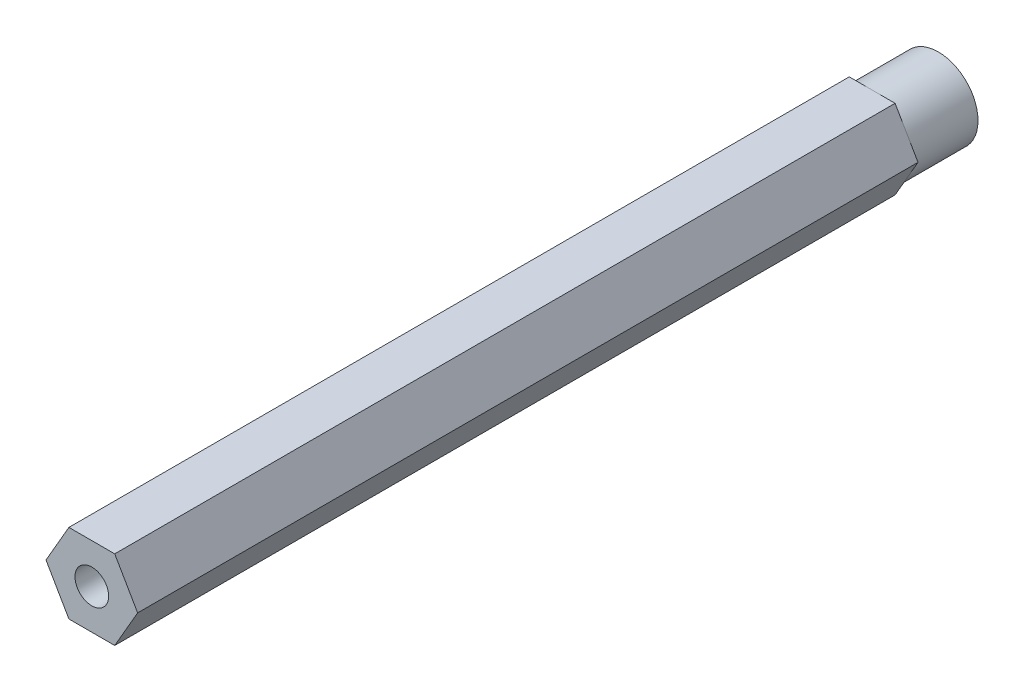
ISO-10303-21;
HEADER;
FILE_DESCRIPTION(('STEP AP214'),'2;1');
FILE_NAME('part.step','',(''),(''),'','','');
FILE_SCHEMA(('AUTOMOTIVE_DESIGN { 1 0 10303 214 1 1 1 1 }'));
ENDSEC;
DATA;
#1=APPLICATION_CONTEXT('core data for automotive mechanical design processes');
#2=APPLICATION_PROTOCOL_DEFINITION('international standard','automotive_design',2000,#1);
#3=PRODUCT_CONTEXT('',#1,'mechanical');
#4=PRODUCT('Part','Part','',(#3));
#5=PRODUCT_RELATED_PRODUCT_CATEGORY('part','',(#4));
#6=PRODUCT_DEFINITION_FORMATION('','',#4);
#7=PRODUCT_DEFINITION_CONTEXT('part definition',#1,'design');
#8=PRODUCT_DEFINITION('design','',#6,#7);
#9=PRODUCT_DEFINITION_SHAPE('','',#8);
#10=(LENGTH_UNIT() NAMED_UNIT(*) SI_UNIT(.MILLI.,.METRE.));
#11=(NAMED_UNIT(*) PLANE_ANGLE_UNIT() SI_UNIT($,.RADIAN.));
#12=(NAMED_UNIT(*) SI_UNIT($,.STERADIAN.) SOLID_ANGLE_UNIT());
#13=UNCERTAINTY_MEASURE_WITH_UNIT(LENGTH_MEASURE(1.E-05),#10,'distance_accuracy_value','');
#14=(GEOMETRIC_REPRESENTATION_CONTEXT(3) GLOBAL_UNCERTAINTY_ASSIGNED_CONTEXT((#13)) GLOBAL_UNIT_ASSIGNED_CONTEXT((#10,
#11,#12)) REPRESENTATION_CONTEXT('',''));
#15=CARTESIAN_POINT('',(0.,0.,0.));
#16=DIRECTION('',(0.,0.,1.));
#17=DIRECTION('',(1.,0.,0.));
#18=AXIS2_PLACEMENT_3D('',#15,#16,#17);
#19=CARTESIAN_POINT('',(-2.74963065701559,-4.7625,101.6));
#20=DIRECTION('',(0.,1.,0.));
#21=DIRECTION('',(-1.,0.,0.));
#22=AXIS2_PLACEMENT_3D('',#19,#20,#21);
#23=PLANE('',#22);
#24=DIRECTION('',(-1.,0.,0.));
#25=VECTOR('',#24,1.);
#26=CARTESIAN_POINT('',(-2.74963065701559,-4.7625,7.9375));
#27=LINE('',#26,#25);
#28=CARTESIAN_POINT('',(2.7496306570156,-4.7625,7.9375));
#29=VERTEX_POINT('',#28);
#30=CARTESIAN_POINT('',(0.,-4.7625,7.9375));
#31=VERTEX_POINT('',#30);
#32=EDGE_CURVE('E137',#29,#31,#27,.T.);
#33=ORIENTED_EDGE('',*,*,#32,.F.);
#34=DIRECTION('',(0.,0.,-1.));
#35=VECTOR('',#34,1.);
#36=CARTESIAN_POINT('',(2.7496306570156,-4.7625,101.6));
#37=LINE('',#36,#35);
#38=CARTESIAN_POINT('',(2.7496306570156,-4.7625,101.6));
#39=VERTEX_POINT('',#38);
#40=EDGE_CURVE('E177',#39,#29,#37,.T.);
#41=ORIENTED_EDGE('',*,*,#40,.F.);
#42=DIRECTION('',(1.,0.,0.));
#43=VECTOR('',#42,1.);
#44=CARTESIAN_POINT('',(-2.74963065701559,-4.7625,101.6));
#45=LINE('',#44,#43);
#46=CARTESIAN_POINT('',(-2.74963065701559,-4.7625,101.6));
#47=VERTEX_POINT('',#46);
#48=EDGE_CURVE('E154',#47,#39,#45,.T.);
#49=ORIENTED_EDGE('',*,*,#48,.F.);
#50=DIRECTION('',(0.,0.,-1.));
#51=VECTOR('',#50,1.);
#52=CARTESIAN_POINT('',(-2.74963065701559,-4.7625,101.6));
#53=LINE('',#52,#51);
#54=CARTESIAN_POINT('',(-2.74963065701559,-4.7625,7.9375));
#55=VERTEX_POINT('',#54);
#56=EDGE_CURVE('E165',#47,#55,#53,.T.);
#57=ORIENTED_EDGE('',*,*,#56,.T.);
#58=EDGE_CURVE('E116',#31,#55,#27,.T.);
#59=ORIENTED_EDGE('',*,*,#58,.F.);
#60=EDGE_LOOP('',(#33,#41,#49,#57,#59));
#61=FACE_BOUND('',#60,.T.);
#62=ADVANCED_FACE('F36',(#61),#23,.F.);
#63=CARTESIAN_POINT('',(2.7496306570156,-4.7625,101.6));
#64=DIRECTION('',(-0.866025403784439,0.5,0.));
#65=DIRECTION('',(-0.5,-0.866025403784439,0.));
#66=AXIS2_PLACEMENT_3D('',#63,#64,#65);
#67=PLANE('',#66);
#68=DIRECTION('',(-0.5,-0.866025403784439,0.));
#69=VECTOR('',#68,1.);
#70=CARTESIAN_POINT('',(2.7496306570156,-4.7625,7.9375));
#71=LINE('',#70,#69);
#72=CARTESIAN_POINT('',(5.49926131403119,0.,7.9375));
#73=VERTEX_POINT('',#72);
#74=CARTESIAN_POINT('',(4.12444598552339,-2.38125,7.9375));
#75=VERTEX_POINT('',#74);
#76=EDGE_CURVE('E144',#73,#75,#71,.T.);
#77=ORIENTED_EDGE('',*,*,#76,.F.);
#78=DIRECTION('',(0.,0.,-1.));
#79=VECTOR('',#78,1.);
#80=CARTESIAN_POINT('',(5.49926131403119,0.,101.6));
#81=LINE('',#80,#79);
#82=CARTESIAN_POINT('',(5.49926131403119,0.,101.6));
#83=VERTEX_POINT('',#82);
#84=EDGE_CURVE('E174',#83,#73,#81,.T.);
#85=ORIENTED_EDGE('',*,*,#84,.F.);
#86=DIRECTION('',(0.5,0.866025403784439,0.));
#87=VECTOR('',#86,1.);
#88=CARTESIAN_POINT('',(2.7496306570156,-4.7625,101.6));
#89=LINE('',#88,#87);
#90=EDGE_CURVE('E156',#39,#83,#89,.T.);
#91=ORIENTED_EDGE('',*,*,#90,.F.);
#92=ORIENTED_EDGE('',*,*,#40,.T.);
#93=EDGE_CURVE('E138',#75,#29,#71,.T.);
#94=ORIENTED_EDGE('',*,*,#93,.F.);
#95=EDGE_LOOP('',(#77,#85,#91,#92,#94));
#96=FACE_BOUND('',#95,.T.);
#97=ADVANCED_FACE('F201',(#96),#67,.F.);
#98=CARTESIAN_POINT('',(5.49926131403119,0.,101.6));
#99=DIRECTION('',(-0.866025403784438,-0.5,0.));
#100=DIRECTION('',(0.5,-0.866025403784438,0.));
#101=AXIS2_PLACEMENT_3D('',#98,#99,#100);
#102=PLANE('',#101);
#103=DIRECTION('',(0.5,-0.866025403784438,0.));
#104=VECTOR('',#103,1.);
#105=CARTESIAN_POINT('',(5.49926131403119,0.,7.9375));
#106=LINE('',#105,#104);
#107=CARTESIAN_POINT('',(2.74963065701559,4.7625,7.9375));
#108=VERTEX_POINT('',#107);
#109=CARTESIAN_POINT('',(4.12444598552339,2.38125,7.9375));
#110=VERTEX_POINT('',#109);
#111=EDGE_CURVE('E147',#108,#110,#106,.T.);
#112=ORIENTED_EDGE('',*,*,#111,.F.);
#113=DIRECTION('',(0.,0.,-1.));
#114=VECTOR('',#113,1.);
#115=CARTESIAN_POINT('',(2.74963065701559,4.7625,101.6));
#116=LINE('',#115,#114);
#117=CARTESIAN_POINT('',(2.74963065701559,4.7625,101.6));
#118=VERTEX_POINT('',#117);
#119=EDGE_CURVE('E171',#118,#108,#116,.T.);
#120=ORIENTED_EDGE('',*,*,#119,.F.);
#121=DIRECTION('',(-0.5,0.866025403784438,0.));
#122=VECTOR('',#121,1.);
#123=CARTESIAN_POINT('',(5.49926131403119,0.,101.6));
#124=LINE('',#123,#122);
#125=EDGE_CURVE('E158',#83,#118,#124,.T.);
#126=ORIENTED_EDGE('',*,*,#125,.F.);
#127=ORIENTED_EDGE('',*,*,#84,.T.);
#128=EDGE_CURVE('E145',#110,#73,#106,.T.);
#129=ORIENTED_EDGE('',*,*,#128,.F.);
#130=EDGE_LOOP('',(#112,#120,#126,#127,#129));
#131=FACE_BOUND('',#130,.T.);
#132=ADVANCED_FACE('F207',(#131),#102,.F.);
#133=CARTESIAN_POINT('',(2.74963065701559,4.7625,101.6));
#134=DIRECTION('',(0.,-1.,0.));
#135=DIRECTION('',(0.,0.,-1.));
#136=AXIS2_PLACEMENT_3D('',#133,#134,#135);
#137=PLANE('',#136);
#138=DIRECTION('',(1.,0.,0.));
#139=VECTOR('',#138,1.);
#140=CARTESIAN_POINT('',(2.74963065701559,4.7625,7.9375));
#141=LINE('',#140,#139);
#142=CARTESIAN_POINT('',(-2.74963065701559,4.7625,7.9375));
#143=VERTEX_POINT('',#142);
#144=CARTESIAN_POINT('',(0.,4.7625,7.9375));
#145=VERTEX_POINT('',#144);
#146=EDGE_CURVE('E129',#143,#145,#141,.T.);
#147=ORIENTED_EDGE('',*,*,#146,.F.);
#148=DIRECTION('',(0.,0.,-1.));
#149=VECTOR('',#148,1.);
#150=CARTESIAN_POINT('',(-2.74963065701559,4.7625,101.6));
#151=LINE('',#150,#149);
#152=CARTESIAN_POINT('',(-2.74963065701559,4.7625,101.6));
#153=VERTEX_POINT('',#152);
#154=EDGE_CURVE('E136',#153,#143,#151,.T.);
#155=ORIENTED_EDGE('',*,*,#154,.F.);
#156=DIRECTION('',(-1.,0.,0.));
#157=VECTOR('',#156,1.);
#158=CARTESIAN_POINT('',(2.74963065701559,4.7625,101.6));
#159=LINE('',#158,#157);
#160=EDGE_CURVE('E160',#118,#153,#159,.T.);
#161=ORIENTED_EDGE('',*,*,#160,.F.);
#162=ORIENTED_EDGE('',*,*,#119,.T.);
#163=EDGE_CURVE('E140',#145,#108,#141,.T.);
#164=ORIENTED_EDGE('',*,*,#163,.F.);
#165=EDGE_LOOP('',(#147,#155,#161,#162,#164));
#166=FACE_BOUND('',#165,.T.);
#167=ADVANCED_FACE('F235',(#166),#137,.F.);
#168=CARTESIAN_POINT('',(-2.74963065701559,4.7625,101.6));
#169=DIRECTION('',(0.866025403784439,-0.5,0.));
#170=DIRECTION('',(0.5,0.866025403784439,0.));
#171=AXIS2_PLACEMENT_3D('',#168,#169,#170);
#172=PLANE('',#171);
#173=DIRECTION('',(0.5,0.866025403784439,0.));
#174=VECTOR('',#173,1.);
#175=CARTESIAN_POINT('',(-2.74963065701559,4.7625,7.9375));
#176=LINE('',#175,#174);
#177=CARTESIAN_POINT('',(-5.49926131403119,0.,7.9375));
#178=VERTEX_POINT('',#177);
#179=CARTESIAN_POINT('',(-4.12444598552339,2.38125,7.9375));
#180=VERTEX_POINT('',#179);
#181=EDGE_CURVE('E108',#178,#180,#176,.T.);
#182=ORIENTED_EDGE('',*,*,#181,.F.);
#183=DIRECTION('',(0.,0.,-1.));
#184=VECTOR('',#183,1.);
#185=CARTESIAN_POINT('',(-5.49926131403119,0.,101.6));
#186=LINE('',#185,#184);
#187=CARTESIAN_POINT('',(-5.49926131403119,0.,101.6));
#188=VERTEX_POINT('',#187);
#189=EDGE_CURVE('E168',#188,#178,#186,.T.);
#190=ORIENTED_EDGE('',*,*,#189,.F.);
#191=DIRECTION('',(-0.5,-0.866025403784439,0.));
#192=VECTOR('',#191,1.);
#193=CARTESIAN_POINT('',(-2.74963065701559,4.7625,101.6));
#194=LINE('',#193,#192);
#195=EDGE_CURVE('E162',#153,#188,#194,.T.);
#196=ORIENTED_EDGE('',*,*,#195,.F.);
#197=ORIENTED_EDGE('',*,*,#154,.T.);
#198=EDGE_CURVE('E119',#180,#143,#176,.T.);
#199=ORIENTED_EDGE('',*,*,#198,.F.);
#200=EDGE_LOOP('',(#182,#190,#196,#197,#199));
#201=FACE_BOUND('',#200,.T.);
#202=ADVANCED_FACE('F133',(#201),#172,.F.);
#203=CARTESIAN_POINT('',(-5.49926131403119,0.,101.6));
#204=DIRECTION('',(0.866025403784438,0.5,0.));
#205=DIRECTION('',(-0.5,0.866025403784438,0.));
#206=AXIS2_PLACEMENT_3D('',#203,#204,#205);
#207=PLANE('',#206);
#208=DIRECTION('',(-0.5,0.866025403784438,0.));
#209=VECTOR('',#208,1.);
#210=CARTESIAN_POINT('',(-5.49926131403119,0.,7.9375));
#211=LINE('',#210,#209);
#212=CARTESIAN_POINT('',(-4.12444598552339,-2.38125,7.9375));
#213=VERTEX_POINT('',#212);
#214=EDGE_CURVE('E12',#55,#213,#211,.T.);
#215=ORIENTED_EDGE('',*,*,#214,.F.);
#216=ORIENTED_EDGE('',*,*,#56,.F.);
#217=DIRECTION('',(0.5,-0.866025403784438,0.));
#218=VECTOR('',#217,1.);
#219=CARTESIAN_POINT('',(-5.49926131403119,0.,101.6));
#220=LINE('',#219,#218);
#221=EDGE_CURVE('E58',#188,#47,#220,.T.);
#222=ORIENTED_EDGE('',*,*,#221,.F.);
#223=ORIENTED_EDGE('',*,*,#189,.T.);
#224=EDGE_CURVE('E39',#213,#178,#211,.T.);
#225=ORIENTED_EDGE('',*,*,#224,.F.);
#226=EDGE_LOOP('',(#215,#216,#222,#223,#225));
#227=FACE_BOUND('',#226,.T.);
#228=ADVANCED_FACE('F187',(#227),#207,.F.);
#229=CARTESIAN_POINT('',(0.,0.,0.));
#230=DIRECTION('',(0.,0.,1.));
#231=DIRECTION('',(1.,0.,0.));
#232=AXIS2_PLACEMENT_3D('',#229,#230,#231);
#233=PLANE('',#232);
#234=CARTESIAN_POINT('',(0.,0.,0.));
#235=DIRECTION('',(0.,0.,1.));
#236=DIRECTION('',(1.,0.,0.));
#237=AXIS2_PLACEMENT_3D('',#234,#235,#236);
#238=CIRCLE('',#237,2.01929999999997);
#239=CARTESIAN_POINT('',(2.01929999999997,0.,0.));
#240=VERTEX_POINT('',#239);
#241=EDGE_CURVE('E151',#240,#240,#238,.T.);
#242=ORIENTED_EDGE('',*,*,#241,.T.);
#243=EDGE_LOOP('',(#242));
#244=FACE_BOUND('',#243,.T.);
#245=CARTESIAN_POINT('',(0.,0.,0.));
#246=DIRECTION('',(0.,0.,1.));
#247=DIRECTION('',(1.,0.,0.));
#248=AXIS2_PLACEMENT_3D('',#245,#246,#247);
#249=CIRCLE('',#248,4.7625);
#250=CARTESIAN_POINT('',(4.7625,0.,0.));
#251=VERTEX_POINT('',#250);
#252=EDGE_CURVE('E179',#251,#251,#249,.T.);
#253=ORIENTED_EDGE('',*,*,#252,.F.);
#254=EDGE_LOOP('',(#253));
#255=FACE_BOUND('',#254,.T.);
#256=ADVANCED_FACE('F184',(#244,#255),#233,.F.);
#257=CARTESIAN_POINT('',(0.,0.,101.6));
#258=DIRECTION('',(0.,0.,1.));
#259=DIRECTION('',(1.,0.,0.));
#260=AXIS2_PLACEMENT_3D('',#257,#258,#259);
#261=PLANE('',#260);
#262=CARTESIAN_POINT('',(0.,0.,101.6));
#263=DIRECTION('',(0.,0.,1.));
#264=DIRECTION('',(1.,0.,0.));
#265=AXIS2_PLACEMENT_3D('',#262,#263,#264);
#266=CIRCLE('',#265,2.01929999999999);
#267=CARTESIAN_POINT('',(2.01929999999999,0.,101.6));
#268=VERTEX_POINT('',#267);
#269=EDGE_CURVE('E148',#268,#268,#266,.T.);
#270=ORIENTED_EDGE('',*,*,#269,.F.);
#271=EDGE_LOOP('',(#270));
#272=FACE_BOUND('',#271,.T.);
#273=ORIENTED_EDGE('',*,*,#48,.T.);
#274=ORIENTED_EDGE('',*,*,#90,.T.);
#275=ORIENTED_EDGE('',*,*,#125,.T.);
#276=ORIENTED_EDGE('',*,*,#160,.T.);
#277=ORIENTED_EDGE('',*,*,#195,.T.);
#278=ORIENTED_EDGE('',*,*,#221,.T.);
#279=EDGE_LOOP('',(#273,#274,#275,#276,#277,#278));
#280=FACE_BOUND('',#279,.T.);
#281=ADVANCED_FACE('F186',(#272,#280),#261,.T.);
#282=CARTESIAN_POINT('',(0.,0.,101.6));
#283=DIRECTION('',(0.,0.,1.));
#284=DIRECTION('',(1.,0.,0.));
#285=AXIS2_PLACEMENT_3D('',#282,#283,#284);
#286=CYLINDRICAL_SURFACE('',#285,2.01929999999998);
#287=ORIENTED_EDGE('',*,*,#241,.F.);
#288=EDGE_LOOP('',(#287));
#289=FACE_BOUND('',#288,.T.);
#290=ORIENTED_EDGE('',*,*,#269,.T.);
#291=EDGE_LOOP('',(#290));
#292=FACE_BOUND('',#291,.T.);
#293=ADVANCED_FACE('F195',(#289,#292),#286,.F.);
#294=CARTESIAN_POINT('',(0.,0.,7.9375));
#295=DIRECTION('',(0.,0.,-1.));
#296=DIRECTION('',(-1.,0.,0.));
#297=AXIS2_PLACEMENT_3D('',#294,#295,#296);
#298=PLANE('',#297);
#299=ORIENTED_EDGE('',*,*,#111,.T.);
#300=CARTESIAN_POINT('',(0.,0.,7.9375));
#301=DIRECTION('',(0.,0.,-1.));
#302=DIRECTION('',(-1.,0.,0.));
#303=AXIS2_PLACEMENT_3D('',#300,#301,#302);
#304=CIRCLE('',#303,4.7625);
#305=EDGE_CURVE('E131',#145,#110,#304,.T.);
#306=ORIENTED_EDGE('',*,*,#305,.F.);
#307=ORIENTED_EDGE('',*,*,#163,.T.);
#308=EDGE_LOOP('',(#299,#306,#307));
#309=FACE_BOUND('',#308,.T.);
#310=ADVANCED_FACE('F233',(#309),#298,.T.);
#311=ORIENTED_EDGE('',*,*,#128,.T.);
#312=ORIENTED_EDGE('',*,*,#76,.T.);
#313=EDGE_CURVE('E225',#110,#75,#304,.T.);
#314=ORIENTED_EDGE('',*,*,#313,.F.);
#315=EDGE_LOOP('',(#311,#312,#314));
#316=FACE_BOUND('',#315,.T.);
#317=ADVANCED_FACE('F232',(#316),#298,.T.);
#318=ORIENTED_EDGE('',*,*,#93,.T.);
#319=ORIENTED_EDGE('',*,*,#32,.T.);
#320=EDGE_CURVE('E222',#75,#31,#304,.T.);
#321=ORIENTED_EDGE('',*,*,#320,.F.);
#322=EDGE_LOOP('',(#318,#319,#321));
#323=FACE_BOUND('',#322,.T.);
#324=ADVANCED_FACE('F268',(#323),#298,.T.);
#325=ORIENTED_EDGE('',*,*,#146,.T.);
#326=EDGE_CURVE('E117',#180,#145,#304,.T.);
#327=ORIENTED_EDGE('',*,*,#326,.F.);
#328=ORIENTED_EDGE('',*,*,#198,.T.);
#329=EDGE_LOOP('',(#325,#327,#328));
#330=FACE_BOUND('',#329,.T.);
#331=ADVANCED_FACE('F127',(#330),#298,.T.);
#332=ORIENTED_EDGE('',*,*,#58,.T.);
#333=ORIENTED_EDGE('',*,*,#214,.T.);
#334=EDGE_CURVE('E50',#31,#213,#304,.T.);
#335=ORIENTED_EDGE('',*,*,#334,.F.);
#336=EDGE_LOOP('',(#332,#333,#335));
#337=FACE_BOUND('',#336,.T.);
#338=ADVANCED_FACE('F221',(#337),#298,.T.);
#339=ORIENTED_EDGE('',*,*,#181,.T.);
#340=EDGE_CURVE('E110',#213,#180,#304,.T.);
#341=ORIENTED_EDGE('',*,*,#340,.F.);
#342=ORIENTED_EDGE('',*,*,#224,.T.);
#343=EDGE_LOOP('',(#339,#341,#342));
#344=FACE_BOUND('',#343,.T.);
#345=ADVANCED_FACE('F109',(#344),#298,.T.);
#346=CARTESIAN_POINT('',(0.,0.,7.9375));
#347=DIRECTION('',(0.,0.,-1.));
#348=DIRECTION('',(-1.,0.,0.));
#349=AXIS2_PLACEMENT_3D('',#346,#347,#348);
#350=CYLINDRICAL_SURFACE('',#349,4.7625);
#351=ORIENTED_EDGE('',*,*,#252,.T.);
#352=EDGE_LOOP('',(#351));
#353=FACE_BOUND('',#352,.T.);
#354=ORIENTED_EDGE('',*,*,#320,.T.);
#355=ORIENTED_EDGE('',*,*,#334,.T.);
#356=ORIENTED_EDGE('',*,*,#340,.T.);
#357=ORIENTED_EDGE('',*,*,#326,.T.);
#358=ORIENTED_EDGE('',*,*,#305,.T.);
#359=ORIENTED_EDGE('',*,*,#313,.T.);
#360=EDGE_LOOP('',(#354,#355,#356,#357,#358,#359));
#361=FACE_BOUND('',#360,.T.);
#362=ADVANCED_FACE('F122',(#353,#361),#350,.T.);
#363=CLOSED_SHELL('',(#62,#97,#132,#167,#202,#228,#256,#281,#293,#310,#317,#324,#331,#338,#345,#362));
#364=MANIFOLD_SOLID_BREP('B2',#363);
#365=ADVANCED_BREP_SHAPE_REPRESENTATION('',(#18,#364),#14);
#366=SHAPE_DEFINITION_REPRESENTATION(#9,#365);
ENDSEC;
END-ISO-10303-21;
